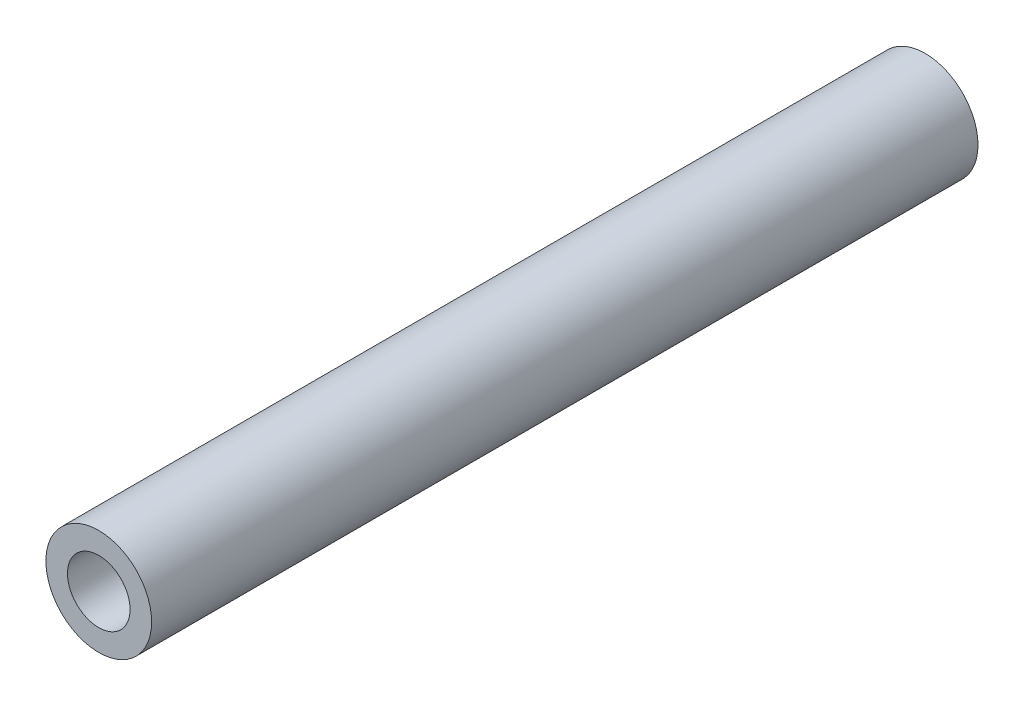
ISO-10303-21;
HEADER;
FILE_DESCRIPTION(('STEP AP214'),'2;1');
FILE_NAME('part.step','',(''),(''),'','','');
FILE_SCHEMA(('AUTOMOTIVE_DESIGN { 1 0 10303 214 1 1 1 1 }'));
ENDSEC;
DATA;
#1=APPLICATION_CONTEXT('core data for automotive mechanical design processes');
#2=APPLICATION_PROTOCOL_DEFINITION('international standard','automotive_design',2000,#1);
#3=PRODUCT_CONTEXT('',#1,'mechanical');
#4=PRODUCT('Part','Part','',(#3));
#5=PRODUCT_RELATED_PRODUCT_CATEGORY('part','',(#4));
#6=PRODUCT_DEFINITION_FORMATION('','',#4);
#7=PRODUCT_DEFINITION_CONTEXT('part definition',#1,'design');
#8=PRODUCT_DEFINITION('design','',#6,#7);
#9=PRODUCT_DEFINITION_SHAPE('','',#8);
#10=(LENGTH_UNIT() NAMED_UNIT(*) SI_UNIT(.MILLI.,.METRE.));
#11=(NAMED_UNIT(*) PLANE_ANGLE_UNIT() SI_UNIT($,.RADIAN.));
#12=(NAMED_UNIT(*) SI_UNIT($,.STERADIAN.) SOLID_ANGLE_UNIT());
#13=UNCERTAINTY_MEASURE_WITH_UNIT(LENGTH_MEASURE(1.E-05),#10,'distance_accuracy_value','');
#14=(GEOMETRIC_REPRESENTATION_CONTEXT(3) GLOBAL_UNCERTAINTY_ASSIGNED_CONTEXT((#13)) GLOBAL_UNIT_ASSIGNED_CONTEXT((#10,
#11,#12)) REPRESENTATION_CONTEXT('',''));
#15=CARTESIAN_POINT('',(0.,0.,0.));
#16=DIRECTION('',(0.,0.,1.));
#17=DIRECTION('',(1.,0.,0.));
#18=AXIS2_PLACEMENT_3D('',#15,#16,#17);
#19=CARTESIAN_POINT('',(0.,0.,38.3));
#20=DIRECTION('',(0.,0.,1.));
#21=DIRECTION('',(1.,0.,0.));
#22=AXIS2_PLACEMENT_3D('',#19,#20,#21);
#23=PLANE('',#22);
#24=CARTESIAN_POINT('',(0.,0.,38.3));
#25=DIRECTION('',(0.,0.,1.));
#26=DIRECTION('',(1.,0.,0.));
#27=AXIS2_PLACEMENT_3D('',#24,#25,#26);
#28=CIRCLE('',#27,2.45);
#29=CARTESIAN_POINT('',(2.45,0.,38.3));
#30=VERTEX_POINT('',#29);
#31=EDGE_CURVE('E10',#30,#30,#28,.T.);
#32=ORIENTED_EDGE('',*,*,#31,.T.);
#33=EDGE_LOOP('',(#32));
#34=FACE_BOUND('',#33,.T.);
#35=CARTESIAN_POINT('',(0.,0.,38.3));
#36=DIRECTION('',(0.,0.,1.));
#37=DIRECTION('',(1.,0.,0.));
#38=AXIS2_PLACEMENT_3D('',#35,#36,#37);
#39=CIRCLE('',#38,1.45);
#40=CARTESIAN_POINT('',(1.45,0.,38.3));
#41=VERTEX_POINT('',#40);
#42=EDGE_CURVE('E42',#41,#41,#39,.T.);
#43=ORIENTED_EDGE('',*,*,#42,.F.);
#44=EDGE_LOOP('',(#43));
#45=FACE_BOUND('',#44,.T.);
#46=ADVANCED_FACE('F31',(#34,#45),#23,.T.);
#47=CARTESIAN_POINT('',(0.,0.,0.));
#48=DIRECTION('',(0.,0.,1.));
#49=DIRECTION('',(1.,0.,0.));
#50=AXIS2_PLACEMENT_3D('',#47,#48,#49);
#51=PLANE('',#50);
#52=CARTESIAN_POINT('',(0.,0.,0.));
#53=DIRECTION('',(0.,0.,1.));
#54=DIRECTION('',(1.,0.,0.));
#55=AXIS2_PLACEMENT_3D('',#52,#53,#54);
#56=CIRCLE('',#55,2.45);
#57=CARTESIAN_POINT('',(2.45,0.,0.));
#58=VERTEX_POINT('',#57);
#59=EDGE_CURVE('E35',#58,#58,#56,.T.);
#60=ORIENTED_EDGE('',*,*,#59,.F.);
#61=EDGE_LOOP('',(#60));
#62=FACE_BOUND('',#61,.T.);
#63=CARTESIAN_POINT('',(0.,0.,0.));
#64=DIRECTION('',(0.,0.,1.));
#65=DIRECTION('',(1.,0.,0.));
#66=AXIS2_PLACEMENT_3D('',#63,#64,#65);
#67=CIRCLE('',#66,1.45);
#68=CARTESIAN_POINT('',(1.45,0.,0.));
#69=VERTEX_POINT('',#68);
#70=EDGE_CURVE('E44',#69,#69,#67,.T.);
#71=ORIENTED_EDGE('',*,*,#70,.T.);
#72=EDGE_LOOP('',(#71));
#73=FACE_BOUND('',#72,.T.);
#74=ADVANCED_FACE('F54',(#62,#73),#51,.F.);
#75=CARTESIAN_POINT('',(0.,0.,38.3));
#76=DIRECTION('',(0.,0.,-1.));
#77=DIRECTION('',(-1.,0.,0.));
#78=AXIS2_PLACEMENT_3D('',#75,#76,#77);
#79=CYLINDRICAL_SURFACE('',#78,2.45);
#80=ORIENTED_EDGE('',*,*,#31,.F.);
#81=EDGE_LOOP('',(#80));
#82=FACE_BOUND('',#81,.T.);
#83=ORIENTED_EDGE('',*,*,#59,.T.);
#84=EDGE_LOOP('',(#83));
#85=FACE_BOUND('',#84,.T.);
#86=ADVANCED_FACE('F33',(#82,#85),#79,.T.);
#87=CARTESIAN_POINT('',(0.,0.,38.3));
#88=DIRECTION('',(0.,0.,-1.));
#89=DIRECTION('',(-1.,0.,0.));
#90=AXIS2_PLACEMENT_3D('',#87,#88,#89);
#91=CYLINDRICAL_SURFACE('',#90,1.45);
#92=ORIENTED_EDGE('',*,*,#42,.T.);
#93=EDGE_LOOP('',(#92));
#94=FACE_BOUND('',#93,.T.);
#95=ORIENTED_EDGE('',*,*,#70,.F.);
#96=EDGE_LOOP('',(#95));
#97=FACE_BOUND('',#96,.T.);
#98=ADVANCED_FACE('F50',(#94,#97),#91,.F.);
#99=CLOSED_SHELL('',(#46,#74,#86,#98));
#100=MANIFOLD_SOLID_BREP('B2',#99);
#101=ADVANCED_BREP_SHAPE_REPRESENTATION('',(#18,#100),#14);
#102=SHAPE_DEFINITION_REPRESENTATION(#9,#101);
ENDSEC;
END-ISO-10303-21;
